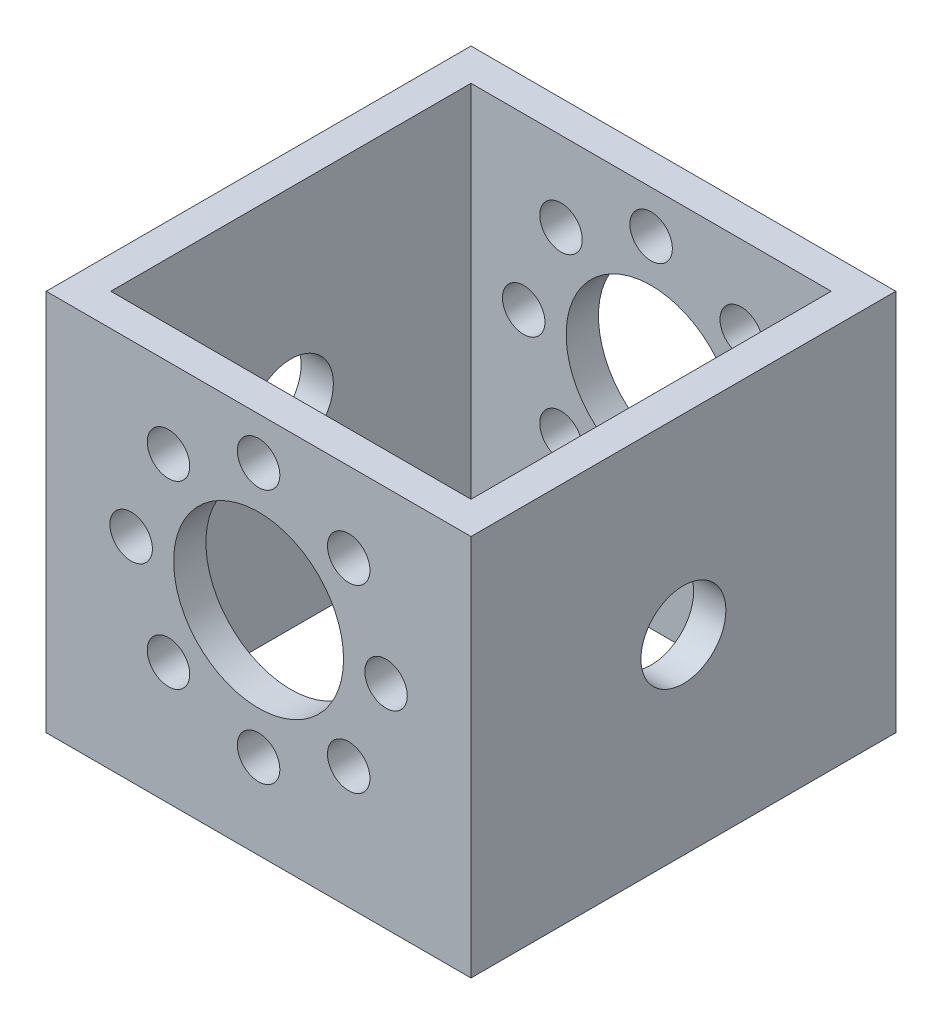
ISO-10303-21;
HEADER;
FILE_DESCRIPTION(('STEP AP214'),'2;1');
FILE_NAME('part.step','',(''),(''),'','','');
FILE_SCHEMA(('AUTOMOTIVE_DESIGN { 1 0 10303 214 1 1 1 1 }'));
ENDSEC;
DATA;
#1=APPLICATION_CONTEXT('core data for automotive mechanical design processes');
#2=APPLICATION_PROTOCOL_DEFINITION('international standard','automotive_design',2000,#1);
#3=PRODUCT_CONTEXT('',#1,'mechanical');
#4=PRODUCT('Part','Part','',(#3));
#5=PRODUCT_RELATED_PRODUCT_CATEGORY('part','',(#4));
#6=PRODUCT_DEFINITION_FORMATION('','',#4);
#7=PRODUCT_DEFINITION_CONTEXT('part definition',#1,'design');
#8=PRODUCT_DEFINITION('design','',#6,#7);
#9=PRODUCT_DEFINITION_SHAPE('','',#8);
#10=(LENGTH_UNIT() NAMED_UNIT(*) SI_UNIT(.MILLI.,.METRE.));
#11=(NAMED_UNIT(*) PLANE_ANGLE_UNIT() SI_UNIT($,.RADIAN.));
#12=(NAMED_UNIT(*) SI_UNIT($,.STERADIAN.) SOLID_ANGLE_UNIT());
#13=UNCERTAINTY_MEASURE_WITH_UNIT(LENGTH_MEASURE(1.E-05),#10,'distance_accuracy_value','');
#14=(GEOMETRIC_REPRESENTATION_CONTEXT(3) GLOBAL_UNCERTAINTY_ASSIGNED_CONTEXT((#13)) GLOBAL_UNIT_ASSIGNED_CONTEXT((#10,
#11,#12)) REPRESENTATION_CONTEXT('',''));
#15=CARTESIAN_POINT('',(0.,0.,0.));
#16=DIRECTION('',(0.,0.,1.));
#17=DIRECTION('',(1.,0.,0.));
#18=AXIS2_PLACEMENT_3D('',#15,#16,#17);
#19=CARTESIAN_POINT('',(0.,0.,4.826));
#20=DIRECTION('',(0.,0.,1.));
#21=DIRECTION('',(1.,0.,0.));
#22=AXIS2_PLACEMENT_3D('',#19,#20,#21);
#23=PLANE('',#22);
#24=CARTESIAN_POINT('',(-19.0499999999992,-8.12150346973795E-13,4.826));
#25=DIRECTION('',(0.,0.,1.));
#26=DIRECTION('',(1.,0.,0.));
#27=AXIS2_PLACEMENT_3D('',#24,#25,#26);
#28=CIRCLE('',#27,3.17500000000121);
#29=CARTESIAN_POINT('',(-15.874999999998,-8.12150346973795E-13,4.826));
#30=VERTEX_POINT('',#29);
#31=EDGE_CURVE('E161',#30,#30,#28,.T.);
#32=ORIENTED_EDGE('',*,*,#31,.F.);
#33=EDGE_LOOP('',(#32));
#34=FACE_BOUND('',#33,.T.);
#35=CARTESIAN_POINT('',(1.61963478964284E-12,-19.05,4.826));
#36=DIRECTION('',(0.,0.,1.));
#37=DIRECTION('',(1.,0.,0.));
#38=AXIS2_PLACEMENT_3D('',#35,#36,#37);
#39=CIRCLE('',#38,3.17500000000168);
#40=CARTESIAN_POINT('',(3.1750000000033,-19.05,4.826));
#41=VERTEX_POINT('',#40);
#42=EDGE_CURVE('E173',#41,#41,#39,.T.);
#43=ORIENTED_EDGE('',*,*,#42,.F.);
#44=EDGE_LOOP('',(#43));
#45=FACE_BOUND('',#44,.T.);
#46=CARTESIAN_POINT('',(19.0500000000008,8.09817394821419E-13,4.826));
#47=DIRECTION('',(0.,0.,1.));
#48=DIRECTION('',(1.,0.,0.));
#49=AXIS2_PLACEMENT_3D('',#46,#47,#48);
#50=CIRCLE('',#49,3.1750000000006);
#51=CARTESIAN_POINT('',(22.2250000000014,8.09817394821419E-13,4.826));
#52=VERTEX_POINT('',#51);
#53=EDGE_CURVE('E185',#52,#52,#50,.T.);
#54=ORIENTED_EDGE('',*,*,#53,.F.);
#55=EDGE_LOOP('',(#54));
#56=FACE_BOUND('',#55,.T.);
#57=CARTESIAN_POINT('',(0.,19.05,4.826));
#58=DIRECTION('',(0.,0.,1.));
#59=DIRECTION('',(1.,0.,0.));
#60=AXIS2_PLACEMENT_3D('',#57,#58,#59);
#61=CIRCLE('',#60,3.175);
#62=CARTESIAN_POINT('',(3.175,19.05,4.826));
#63=VERTEX_POINT('',#62);
#64=EDGE_CURVE('E197',#63,#63,#61,.T.);
#65=ORIENTED_EDGE('',*,*,#64,.F.);
#66=EDGE_LOOP('',(#65));
#67=FACE_BOUND('',#66,.T.);
#68=CARTESIAN_POINT('',(0.,0.,4.826));
#69=DIRECTION('',(0.,0.,1.));
#70=DIRECTION('',(1.,0.,0.));
#71=AXIS2_PLACEMENT_3D('',#68,#69,#70);
#72=CIRCLE('',#71,12.7);
#73=CARTESIAN_POINT('',(12.7,0.,4.826));
#74=VERTEX_POINT('',#73);
#75=EDGE_CURVE('E203',#74,#74,#72,.T.);
#76=ORIENTED_EDGE('',*,*,#75,.F.);
#77=EDGE_LOOP('',(#76));
#78=FACE_BOUND('',#77,.T.);
#79=CARTESIAN_POINT('',(13.4703841816038,13.4703841816037,4.826));
#80=DIRECTION('',(0.,0.,1.));
#81=DIRECTION('',(1.,0.,0.));
#82=AXIS2_PLACEMENT_3D('',#79,#80,#81);
#83=CIRCLE('',#82,3.175);
#84=CARTESIAN_POINT('',(16.6453841816038,13.4703841816037,4.826));
#85=VERTEX_POINT('',#84);
#86=EDGE_CURVE('E191',#85,#85,#83,.T.);
#87=ORIENTED_EDGE('',*,*,#86,.F.);
#88=EDGE_LOOP('',(#87));
#89=FACE_BOUND('',#88,.T.);
#90=CARTESIAN_POINT('',(13.4703841816051,-13.4703841816032,4.826));
#91=DIRECTION('',(0.,0.,1.));
#92=DIRECTION('',(1.,0.,0.));
#93=AXIS2_PLACEMENT_3D('',#90,#91,#92);
#94=CIRCLE('',#93,3.17500000000125);
#95=CARTESIAN_POINT('',(16.6453841816064,-13.4703841816032,4.826));
#96=VERTEX_POINT('',#95);
#97=EDGE_CURVE('E179',#96,#96,#94,.T.);
#98=ORIENTED_EDGE('',*,*,#97,.F.);
#99=EDGE_LOOP('',(#98));
#100=FACE_BOUND('',#99,.T.);
#101=CARTESIAN_POINT('',(-13.4703841816024,-13.4703841816043,4.826));
#102=DIRECTION('',(0.,0.,1.));
#103=DIRECTION('',(1.,0.,0.));
#104=AXIS2_PLACEMENT_3D('',#101,#102,#103);
#105=CIRCLE('',#104,3.17500000000165);
#106=CARTESIAN_POINT('',(-10.2953841816007,-13.4703841816043,4.826));
#107=VERTEX_POINT('',#106);
#108=EDGE_CURVE('E167',#107,#107,#105,.T.);
#109=ORIENTED_EDGE('',*,*,#108,.F.);
#110=EDGE_LOOP('',(#109));
#111=FACE_BOUND('',#110,.T.);
#112=CARTESIAN_POINT('',(-13.4703841816035,13.4703841816032,4.826));
#113=DIRECTION('',(0.,0.,1.));
#114=DIRECTION('',(1.,0.,0.));
#115=AXIS2_PLACEMENT_3D('',#112,#113,#114);
#116=CIRCLE('',#115,3.17500000000062);
#117=CARTESIAN_POINT('',(-10.2953841816029,13.4703841816032,4.826));
#118=VERTEX_POINT('',#117);
#119=EDGE_CURVE('E155',#118,#118,#116,.T.);
#120=ORIENTED_EDGE('',*,*,#119,.F.);
#121=EDGE_LOOP('',(#120));
#122=FACE_BOUND('',#121,.T.);
#123=DIRECTION('',(-1.,0.,0.));
#124=VECTOR('',#123,1.);
#125=CARTESIAN_POINT('',(-31.75,25.4,4.826));
#126=LINE('',#125,#124);
#127=CARTESIAN_POINT('',(26.924,25.4,4.826));
#128=VERTEX_POINT('',#127);
#129=CARTESIAN_POINT('',(-26.924,25.4,4.826));
#130=VERTEX_POINT('',#129);
#131=EDGE_CURVE('E55',#128,#130,#126,.T.);
#132=ORIENTED_EDGE('',*,*,#131,.T.);
#133=DIRECTION('',(0.,1.,0.));
#134=VECTOR('',#133,1.);
#135=CARTESIAN_POINT('',(-26.924,-31.75,4.826));
#136=LINE('',#135,#134);
#137=CARTESIAN_POINT('',(-26.924,-31.75,4.826));
#138=VERTEX_POINT('',#137);
#139=EDGE_CURVE('E50',#138,#130,#136,.T.);
#140=ORIENTED_EDGE('',*,*,#139,.F.);
#141=DIRECTION('',(1.,0.,0.));
#142=VECTOR('',#141,1.);
#143=CARTESIAN_POINT('',(-31.75,-31.75,4.826));
#144=LINE('',#143,#142);
#145=CARTESIAN_POINT('',(26.924,-31.75,4.826));
#146=VERTEX_POINT('',#145);
#147=EDGE_CURVE('E209',#138,#146,#144,.T.);
#148=ORIENTED_EDGE('',*,*,#147,.T.);
#149=DIRECTION('',(0.,1.,0.));
#150=VECTOR('',#149,1.);
#151=CARTESIAN_POINT('',(26.924,-31.75,4.826));
#152=LINE('',#151,#150);
#153=EDGE_CURVE('E144',#146,#128,#152,.T.);
#154=ORIENTED_EDGE('',*,*,#153,.T.);
#155=EDGE_LOOP('',(#132,#140,#148,#154));
#156=FACE_BOUND('',#155,.T.);
#157=ADVANCED_FACE('F35',(#34,#45,#56,#67,#78,#89,#100,#111,#122,#156),#23,.T.);
#158=CARTESIAN_POINT('',(0.,0.,58.674));
#159=DIRECTION('',(0.,0.,-1.));
#160=DIRECTION('',(1.,0.,0.));
#161=AXIS2_PLACEMENT_3D('',#158,#159,#160);
#162=PLANE('',#161);
#163=CARTESIAN_POINT('',(-13.4703841816035,13.4703841816032,58.674));
#164=DIRECTION('',(0.,0.,1.));
#165=DIRECTION('',(1.,0.,0.));
#166=AXIS2_PLACEMENT_3D('',#163,#164,#165);
#167=CIRCLE('',#166,3.17500000000062);
#168=CARTESIAN_POINT('',(-10.2953841816029,13.4703841816032,58.674));
#169=VERTEX_POINT('',#168);
#170=EDGE_CURVE('E557',#169,#169,#167,.T.);
#171=ORIENTED_EDGE('',*,*,#170,.T.);
#172=EDGE_LOOP('',(#171));
#173=FACE_BOUND('',#172,.T.);
#174=CARTESIAN_POINT('',(-19.0499999999992,-8.12150346973795E-13,58.674));
#175=DIRECTION('',(0.,0.,1.));
#176=DIRECTION('',(1.,0.,0.));
#177=AXIS2_PLACEMENT_3D('',#174,#175,#176);
#178=CIRCLE('',#177,3.17500000000121);
#179=CARTESIAN_POINT('',(-15.874999999998,-8.12150346973795E-13,58.674));
#180=VERTEX_POINT('',#179);
#181=EDGE_CURVE('E563',#180,#180,#178,.T.);
#182=ORIENTED_EDGE('',*,*,#181,.T.);
#183=EDGE_LOOP('',(#182));
#184=FACE_BOUND('',#183,.T.);
#185=CARTESIAN_POINT('',(-13.4703841816024,-13.4703841816043,58.674));
#186=DIRECTION('',(0.,0.,1.));
#187=DIRECTION('',(1.,0.,0.));
#188=AXIS2_PLACEMENT_3D('',#185,#186,#187);
#189=CIRCLE('',#188,3.17500000000165);
#190=CARTESIAN_POINT('',(-10.2953841816007,-13.4703841816043,58.674));
#191=VERTEX_POINT('',#190);
#192=EDGE_CURVE('E569',#191,#191,#189,.T.);
#193=ORIENTED_EDGE('',*,*,#192,.T.);
#194=EDGE_LOOP('',(#193));
#195=FACE_BOUND('',#194,.T.);
#196=CARTESIAN_POINT('',(1.61963478964284E-12,-19.05,58.674));
#197=DIRECTION('',(0.,0.,1.));
#198=DIRECTION('',(1.,0.,0.));
#199=AXIS2_PLACEMENT_3D('',#196,#197,#198);
#200=CIRCLE('',#199,3.17500000000168);
#201=CARTESIAN_POINT('',(3.1750000000033,-19.05,58.674));
#202=VERTEX_POINT('',#201);
#203=EDGE_CURVE('E575',#202,#202,#200,.T.);
#204=ORIENTED_EDGE('',*,*,#203,.T.);
#205=EDGE_LOOP('',(#204));
#206=FACE_BOUND('',#205,.T.);
#207=CARTESIAN_POINT('',(13.4703841816051,-13.4703841816032,58.674));
#208=DIRECTION('',(0.,0.,1.));
#209=DIRECTION('',(1.,0.,0.));
#210=AXIS2_PLACEMENT_3D('',#207,#208,#209);
#211=CIRCLE('',#210,3.17500000000125);
#212=CARTESIAN_POINT('',(16.6453841816064,-13.4703841816032,58.674));
#213=VERTEX_POINT('',#212);
#214=EDGE_CURVE('E581',#213,#213,#211,.T.);
#215=ORIENTED_EDGE('',*,*,#214,.T.);
#216=EDGE_LOOP('',(#215));
#217=FACE_BOUND('',#216,.T.);
#218=CARTESIAN_POINT('',(19.0500000000008,8.09817394821419E-13,58.674));
#219=DIRECTION('',(0.,0.,1.));
#220=DIRECTION('',(1.,0.,0.));
#221=AXIS2_PLACEMENT_3D('',#218,#219,#220);
#222=CIRCLE('',#221,3.1750000000006);
#223=CARTESIAN_POINT('',(22.2250000000014,8.09817394821419E-13,58.674));
#224=VERTEX_POINT('',#223);
#225=EDGE_CURVE('E587',#224,#224,#222,.T.);
#226=ORIENTED_EDGE('',*,*,#225,.T.);
#227=EDGE_LOOP('',(#226));
#228=FACE_BOUND('',#227,.T.);
#229=CARTESIAN_POINT('',(13.4703841816038,13.4703841816037,58.674));
#230=DIRECTION('',(0.,0.,1.));
#231=DIRECTION('',(1.,0.,0.));
#232=AXIS2_PLACEMENT_3D('',#229,#230,#231);
#233=CIRCLE('',#232,3.175);
#234=CARTESIAN_POINT('',(16.6453841816038,13.4703841816037,58.674));
#235=VERTEX_POINT('',#234);
#236=EDGE_CURVE('E593',#235,#235,#233,.T.);
#237=ORIENTED_EDGE('',*,*,#236,.T.);
#238=EDGE_LOOP('',(#237));
#239=FACE_BOUND('',#238,.T.);
#240=CARTESIAN_POINT('',(0.,19.05,58.674));
#241=DIRECTION('',(0.,0.,1.));
#242=DIRECTION('',(1.,0.,0.));
#243=AXIS2_PLACEMENT_3D('',#240,#241,#242);
#244=CIRCLE('',#243,3.175);
#245=CARTESIAN_POINT('',(3.175,19.05,58.674));
#246=VERTEX_POINT('',#245);
#247=EDGE_CURVE('E599',#246,#246,#244,.T.);
#248=ORIENTED_EDGE('',*,*,#247,.T.);
#249=EDGE_LOOP('',(#248));
#250=FACE_BOUND('',#249,.T.);
#251=CARTESIAN_POINT('',(0.,0.,58.674));
#252=DIRECTION('',(0.,0.,1.));
#253=DIRECTION('',(1.,0.,0.));
#254=AXIS2_PLACEMENT_3D('',#251,#252,#253);
#255=CIRCLE('',#254,12.7);
#256=CARTESIAN_POINT('',(12.7,0.,58.674));
#257=VERTEX_POINT('',#256);
#258=EDGE_CURVE('E136',#257,#257,#255,.T.);
#259=ORIENTED_EDGE('',*,*,#258,.T.);
#260=EDGE_LOOP('',(#259));
#261=FACE_BOUND('',#260,.T.);
#262=DIRECTION('',(1.,0.,0.));
#263=VECTOR('',#262,1.);
#264=CARTESIAN_POINT('',(-31.75,-31.75,58.674));
#265=LINE('',#264,#263);
#266=CARTESIAN_POINT('',(-26.924,-31.75,58.674));
#267=VERTEX_POINT('',#266);
#268=CARTESIAN_POINT('',(26.924,-31.75,58.674));
#269=VERTEX_POINT('',#268);
#270=EDGE_CURVE('E115',#267,#269,#265,.T.);
#271=ORIENTED_EDGE('',*,*,#270,.F.);
#272=DIRECTION('',(0.,-1.,0.));
#273=VECTOR('',#272,1.);
#274=CARTESIAN_POINT('',(-26.924,25.4,58.674));
#275=LINE('',#274,#273);
#276=CARTESIAN_POINT('',(-26.924,25.4,58.674));
#277=VERTEX_POINT('',#276);
#278=EDGE_CURVE('E104',#277,#267,#275,.T.);
#279=ORIENTED_EDGE('',*,*,#278,.F.);
#280=DIRECTION('',(-1.,0.,0.));
#281=VECTOR('',#280,1.);
#282=CARTESIAN_POINT('',(-31.75,25.4,58.674));
#283=LINE('',#282,#281);
#284=CARTESIAN_POINT('',(26.924,25.4,58.674));
#285=VERTEX_POINT('',#284);
#286=EDGE_CURVE('E114',#285,#277,#283,.T.);
#287=ORIENTED_EDGE('',*,*,#286,.F.);
#288=DIRECTION('',(0.,-1.,0.));
#289=VECTOR('',#288,1.);
#290=CARTESIAN_POINT('',(26.924,25.4,58.674));
#291=LINE('',#290,#289);
#292=EDGE_CURVE('E149',#285,#269,#291,.T.);
#293=ORIENTED_EDGE('',*,*,#292,.T.);
#294=EDGE_LOOP('',(#271,#279,#287,#293));
#295=FACE_BOUND('',#294,.T.);
#296=ADVANCED_FACE('F112',(#173,#184,#195,#206,#217,#228,#239,#250,#261,#295),#162,.T.);
#297=CARTESIAN_POINT('',(0.,0.,0.));
#298=DIRECTION('',(0.,0.,1.));
#299=DIRECTION('',(1.,0.,0.));
#300=AXIS2_PLACEMENT_3D('',#297,#298,#299);
#301=PLANE('',#300);
#302=DIRECTION('',(0.,-1.,0.));
#303=VECTOR('',#302,1.);
#304=CARTESIAN_POINT('',(-31.75,25.4,0.));
#305=LINE('',#304,#303);
#306=CARTESIAN_POINT('',(-31.75,25.4,0.));
#307=VERTEX_POINT('',#306);
#308=CARTESIAN_POINT('',(-31.75,-31.75,0.));
#309=VERTEX_POINT('',#308);
#310=EDGE_CURVE('E206',#307,#309,#305,.T.);
#311=ORIENTED_EDGE('',*,*,#310,.F.);
#312=DIRECTION('',(-1.,0.,0.));
#313=VECTOR('',#312,1.);
#314=CARTESIAN_POINT('',(-31.75,25.4,0.));
#315=LINE('',#314,#313);
#316=CARTESIAN_POINT('',(31.75,25.4,0.));
#317=VERTEX_POINT('',#316);
#318=EDGE_CURVE('E211',#317,#307,#315,.T.);
#319=ORIENTED_EDGE('',*,*,#318,.F.);
#320=DIRECTION('',(0.,1.,0.));
#321=VECTOR('',#320,1.);
#322=CARTESIAN_POINT('',(31.75,25.4,0.));
#323=LINE('',#322,#321);
#324=CARTESIAN_POINT('',(31.75,-31.75,0.));
#325=VERTEX_POINT('',#324);
#326=EDGE_CURVE('E218',#325,#317,#323,.T.);
#327=ORIENTED_EDGE('',*,*,#326,.F.);
#328=DIRECTION('',(1.,0.,0.));
#329=VECTOR('',#328,1.);
#330=CARTESIAN_POINT('',(-31.75,-31.75,0.));
#331=LINE('',#330,#329);
#332=EDGE_CURVE('E216',#309,#325,#331,.T.);
#333=ORIENTED_EDGE('',*,*,#332,.F.);
#334=EDGE_LOOP('',(#311,#319,#327,#333));
#335=FACE_BOUND('',#334,.T.);
#336=CARTESIAN_POINT('',(0.,0.,0.));
#337=DIRECTION('',(0.,0.,1.));
#338=DIRECTION('',(1.,0.,0.));
#339=AXIS2_PLACEMENT_3D('',#336,#337,#338);
#340=CIRCLE('',#339,12.7);
#341=CARTESIAN_POINT('',(12.7,0.,0.));
#342=VERTEX_POINT('',#341);
#343=EDGE_CURVE('E200',#342,#342,#340,.T.);
#344=ORIENTED_EDGE('',*,*,#343,.T.);
#345=EDGE_LOOP('',(#344));
#346=FACE_BOUND('',#345,.T.);
#347=CARTESIAN_POINT('',(0.,19.05,0.));
#348=DIRECTION('',(0.,0.,1.));
#349=DIRECTION('',(1.,0.,0.));
#350=AXIS2_PLACEMENT_3D('',#347,#348,#349);
#351=CIRCLE('',#350,3.175);
#352=CARTESIAN_POINT('',(3.175,19.05,0.));
#353=VERTEX_POINT('',#352);
#354=EDGE_CURVE('E194',#353,#353,#351,.T.);
#355=ORIENTED_EDGE('',*,*,#354,.T.);
#356=EDGE_LOOP('',(#355));
#357=FACE_BOUND('',#356,.T.);
#358=CARTESIAN_POINT('',(13.4703841816038,13.4703841816037,0.));
#359=DIRECTION('',(0.,0.,1.));
#360=DIRECTION('',(1.,0.,0.));
#361=AXIS2_PLACEMENT_3D('',#358,#359,#360);
#362=CIRCLE('',#361,3.175);
#363=CARTESIAN_POINT('',(16.6453841816038,13.4703841816037,0.));
#364=VERTEX_POINT('',#363);
#365=EDGE_CURVE('E188',#364,#364,#362,.T.);
#366=ORIENTED_EDGE('',*,*,#365,.T.);
#367=EDGE_LOOP('',(#366));
#368=FACE_BOUND('',#367,.T.);
#369=CARTESIAN_POINT('',(19.0500000000008,8.09817394821419E-13,0.));
#370=DIRECTION('',(0.,0.,1.));
#371=DIRECTION('',(1.,0.,0.));
#372=AXIS2_PLACEMENT_3D('',#369,#370,#371);
#373=CIRCLE('',#372,3.1750000000006);
#374=CARTESIAN_POINT('',(22.2250000000014,8.09817394821419E-13,0.));
#375=VERTEX_POINT('',#374);
#376=EDGE_CURVE('E182',#375,#375,#373,.T.);
#377=ORIENTED_EDGE('',*,*,#376,.T.);
#378=EDGE_LOOP('',(#377));
#379=FACE_BOUND('',#378,.T.);
#380=CARTESIAN_POINT('',(13.4703841816051,-13.4703841816032,0.));
#381=DIRECTION('',(0.,0.,1.));
#382=DIRECTION('',(1.,0.,0.));
#383=AXIS2_PLACEMENT_3D('',#380,#381,#382);
#384=CIRCLE('',#383,3.17500000000125);
#385=CARTESIAN_POINT('',(16.6453841816064,-13.4703841816032,0.));
#386=VERTEX_POINT('',#385);
#387=EDGE_CURVE('E176',#386,#386,#384,.T.);
#388=ORIENTED_EDGE('',*,*,#387,.T.);
#389=EDGE_LOOP('',(#388));
#390=FACE_BOUND('',#389,.T.);
#391=CARTESIAN_POINT('',(1.61963478964284E-12,-19.05,0.));
#392=DIRECTION('',(0.,0.,1.));
#393=DIRECTION('',(1.,0.,0.));
#394=AXIS2_PLACEMENT_3D('',#391,#392,#393);
#395=CIRCLE('',#394,3.17500000000168);
#396=CARTESIAN_POINT('',(3.1750000000033,-19.05,0.));
#397=VERTEX_POINT('',#396);
#398=EDGE_CURVE('E170',#397,#397,#395,.T.);
#399=ORIENTED_EDGE('',*,*,#398,.T.);
#400=EDGE_LOOP('',(#399));
#401=FACE_BOUND('',#400,.T.);
#402=CARTESIAN_POINT('',(-13.4703841816024,-13.4703841816043,0.));
#403=DIRECTION('',(0.,0.,1.));
#404=DIRECTION('',(1.,0.,0.));
#405=AXIS2_PLACEMENT_3D('',#402,#403,#404);
#406=CIRCLE('',#405,3.17500000000165);
#407=CARTESIAN_POINT('',(-10.2953841816007,-13.4703841816043,0.));
#408=VERTEX_POINT('',#407);
#409=EDGE_CURVE('E164',#408,#408,#406,.T.);
#410=ORIENTED_EDGE('',*,*,#409,.T.);
#411=EDGE_LOOP('',(#410));
#412=FACE_BOUND('',#411,.T.);
#413=CARTESIAN_POINT('',(-19.0499999999992,-8.12150346973795E-13,0.));
#414=DIRECTION('',(0.,0.,1.));
#415=DIRECTION('',(1.,0.,0.));
#416=AXIS2_PLACEMENT_3D('',#413,#414,#415);
#417=CIRCLE('',#416,3.17500000000121);
#418=CARTESIAN_POINT('',(-15.874999999998,-8.12150346973795E-13,0.));
#419=VERTEX_POINT('',#418);
#420=EDGE_CURVE('E158',#419,#419,#417,.T.);
#421=ORIENTED_EDGE('',*,*,#420,.T.);
#422=EDGE_LOOP('',(#421));
#423=FACE_BOUND('',#422,.T.);
#424=CARTESIAN_POINT('',(-13.4703841816035,13.4703841816032,0.));
#425=DIRECTION('',(0.,0.,1.));
#426=DIRECTION('',(1.,0.,0.));
#427=AXIS2_PLACEMENT_3D('',#424,#425,#426);
#428=CIRCLE('',#427,3.17500000000062);
#429=CARTESIAN_POINT('',(-10.2953841816029,13.4703841816032,0.));
#430=VERTEX_POINT('',#429);
#431=EDGE_CURVE('E154',#430,#430,#428,.T.);
#432=ORIENTED_EDGE('',*,*,#431,.T.);
#433=EDGE_LOOP('',(#432));
#434=FACE_BOUND('',#433,.T.);
#435=ADVANCED_FACE('F236',(#335,#346,#357,#368,#379,#390,#401,#412,#423,#434),#301,.F.);
#436=CARTESIAN_POINT('',(-31.75,25.4,4.826));
#437=DIRECTION('',(1.,0.,0.));
#438=DIRECTION('',(0.,1.,0.));
#439=AXIS2_PLACEMENT_3D('',#436,#437,#438);
#440=PLANE('',#439);
#441=ORIENTED_EDGE('',*,*,#310,.T.);
#442=DIRECTION('',(0.,0.,-1.));
#443=VECTOR('',#442,1.);
#444=CARTESIAN_POINT('',(-31.75,-31.75,4.826));
#445=LINE('',#444,#443);
#446=CARTESIAN_POINT('',(-31.75,-31.75,63.5));
#447=VERTEX_POINT('',#446);
#448=EDGE_CURVE('E11',#447,#309,#445,.T.);
#449=ORIENTED_EDGE('',*,*,#448,.F.);
#450=DIRECTION('',(0.,-1.,0.));
#451=VECTOR('',#450,1.);
#452=CARTESIAN_POINT('',(-31.75,25.4,63.5));
#453=LINE('',#452,#451);
#454=CARTESIAN_POINT('',(-31.75,25.4,63.5));
#455=VERTEX_POINT('',#454);
#456=EDGE_CURVE('E132',#455,#447,#453,.T.);
#457=ORIENTED_EDGE('',*,*,#456,.F.);
#458=DIRECTION('',(0.,0.,-1.));
#459=VECTOR('',#458,1.);
#460=CARTESIAN_POINT('',(-31.75,25.4,4.826));
#461=LINE('',#460,#459);
#462=EDGE_CURVE('E213',#455,#307,#461,.T.);
#463=ORIENTED_EDGE('',*,*,#462,.T.);
#464=EDGE_LOOP('',(#441,#449,#457,#463));
#465=FACE_BOUND('',#464,.T.);
#466=CARTESIAN_POINT('',(-31.75,-3.17500000000001,31.75));
#467=DIRECTION('',(1.,0.,0.));
#468=DIRECTION('',(0.,0.,-1.));
#469=AXIS2_PLACEMENT_3D('',#466,#467,#468);
#470=CIRCLE('',#469,6.35);
#471=CARTESIAN_POINT('',(-31.75,-3.17500000000001,25.4));
#472=VERTEX_POINT('',#471);
#473=EDGE_CURVE('E551',#472,#472,#470,.T.);
#474=ORIENTED_EDGE('',*,*,#473,.T.);
#475=EDGE_LOOP('',(#474));
#476=FACE_BOUND('',#475,.T.);
#477=ADVANCED_FACE('F37',(#465,#476),#440,.F.);
#478=CARTESIAN_POINT('',(-31.75,-31.75,4.826));
#479=DIRECTION('',(0.,1.,0.));
#480=DIRECTION('',(-1.,0.,0.));
#481=AXIS2_PLACEMENT_3D('',#478,#479,#480);
#482=PLANE('',#481);
#483=ORIENTED_EDGE('',*,*,#147,.F.);
#484=DIRECTION('',(0.,0.,-1.));
#485=VECTOR('',#484,1.);
#486=CARTESIAN_POINT('',(-26.924,-31.75,58.674));
#487=LINE('',#486,#485);
#488=EDGE_CURVE('E116',#267,#138,#487,.T.);
#489=ORIENTED_EDGE('',*,*,#488,.F.);
#490=ORIENTED_EDGE('',*,*,#270,.T.);
#491=DIRECTION('',(0.,0.,-1.));
#492=VECTOR('',#491,1.);
#493=CARTESIAN_POINT('',(26.924,-31.75,58.674));
#494=LINE('',#493,#492);
#495=EDGE_CURVE('E151',#269,#146,#494,.T.);
#496=ORIENTED_EDGE('',*,*,#495,.T.);
#497=EDGE_LOOP('',(#483,#489,#490,#496));
#498=FACE_BOUND('',#497,.T.);
#499=ORIENTED_EDGE('',*,*,#332,.T.);
#500=DIRECTION('',(0.,0.,-1.));
#501=VECTOR('',#500,1.);
#502=CARTESIAN_POINT('',(31.75,-31.75,4.826));
#503=LINE('',#502,#501);
#504=CARTESIAN_POINT('',(31.75,-31.75,63.5));
#505=VERTEX_POINT('',#504);
#506=EDGE_CURVE('E43',#505,#325,#503,.T.);
#507=ORIENTED_EDGE('',*,*,#506,.F.);
#508=DIRECTION('',(1.,0.,0.));
#509=VECTOR('',#508,1.);
#510=CARTESIAN_POINT('',(-31.75,-31.75,63.5));
#511=LINE('',#510,#509);
#512=EDGE_CURVE('E121',#447,#505,#511,.T.);
#513=ORIENTED_EDGE('',*,*,#512,.F.);
#514=ORIENTED_EDGE('',*,*,#448,.T.);
#515=EDGE_LOOP('',(#499,#507,#513,#514));
#516=FACE_BOUND('',#515,.T.);
#517=ADVANCED_FACE('F245',(#498,#516),#482,.F.);
#518=CARTESIAN_POINT('',(31.75,25.4,4.826));
#519=DIRECTION('',(-1.,0.,0.));
#520=DIRECTION('',(0.,0.,1.));
#521=AXIS2_PLACEMENT_3D('',#518,#519,#520);
#522=PLANE('',#521);
#523=ORIENTED_EDGE('',*,*,#326,.T.);
#524=DIRECTION('',(0.,0.,-1.));
#525=VECTOR('',#524,1.);
#526=CARTESIAN_POINT('',(31.75,25.4,4.826));
#527=LINE('',#526,#525);
#528=CARTESIAN_POINT('',(31.75,25.4,63.5));
#529=VERTEX_POINT('',#528);
#530=EDGE_CURVE('E223',#529,#317,#527,.T.);
#531=ORIENTED_EDGE('',*,*,#530,.F.);
#532=DIRECTION('',(0.,1.,0.));
#533=VECTOR('',#532,1.);
#534=CARTESIAN_POINT('',(31.75,25.4,63.5));
#535=LINE('',#534,#533);
#536=EDGE_CURVE('E126',#505,#529,#535,.T.);
#537=ORIENTED_EDGE('',*,*,#536,.F.);
#538=ORIENTED_EDGE('',*,*,#506,.T.);
#539=EDGE_LOOP('',(#523,#531,#537,#538));
#540=FACE_BOUND('',#539,.T.);
#541=CARTESIAN_POINT('',(31.75,-3.175,31.75));
#542=DIRECTION('',(1.,0.,0.));
#543=DIRECTION('',(0.,0.,-1.));
#544=AXIS2_PLACEMENT_3D('',#541,#542,#543);
#545=CIRCLE('',#544,6.35);
#546=CARTESIAN_POINT('',(31.75,-3.175,25.4));
#547=VERTEX_POINT('',#546);
#548=EDGE_CURVE('E123',#547,#547,#545,.T.);
#549=ORIENTED_EDGE('',*,*,#548,.F.);
#550=EDGE_LOOP('',(#549));
#551=FACE_BOUND('',#550,.T.);
#552=ADVANCED_FACE('F229',(#540,#551),#522,.F.);
#553=CARTESIAN_POINT('',(-31.75,25.4,4.826));
#554=DIRECTION('',(0.,-1.,0.));
#555=DIRECTION('',(1.,0.,0.));
#556=AXIS2_PLACEMENT_3D('',#553,#554,#555);
#557=PLANE('',#556);
#558=ORIENTED_EDGE('',*,*,#462,.F.);
#559=DIRECTION('',(-1.,0.,0.));
#560=VECTOR('',#559,1.);
#561=CARTESIAN_POINT('',(-31.75,25.4,63.5));
#562=LINE('',#561,#560);
#563=EDGE_CURVE('E135',#529,#455,#562,.T.);
#564=ORIENTED_EDGE('',*,*,#563,.F.);
#565=ORIENTED_EDGE('',*,*,#530,.T.);
#566=ORIENTED_EDGE('',*,*,#318,.T.);
#567=EDGE_LOOP('',(#558,#564,#565,#566));
#568=FACE_BOUND('',#567,.T.);
#569=DIRECTION('',(0.,0.,1.));
#570=VECTOR('',#569,1.);
#571=CARTESIAN_POINT('',(-26.924,25.4,4.826));
#572=LINE('',#571,#570);
#573=EDGE_CURVE('E99',#130,#277,#572,.T.);
#574=ORIENTED_EDGE('',*,*,#573,.F.);
#575=ORIENTED_EDGE('',*,*,#131,.F.);
#576=DIRECTION('',(0.,0.,1.));
#577=VECTOR('',#576,1.);
#578=CARTESIAN_POINT('',(26.924,25.4,4.826));
#579=LINE('',#578,#577);
#580=EDGE_CURVE('E120',#128,#285,#579,.T.);
#581=ORIENTED_EDGE('',*,*,#580,.T.);
#582=ORIENTED_EDGE('',*,*,#286,.T.);
#583=EDGE_LOOP('',(#574,#575,#581,#582));
#584=FACE_BOUND('',#583,.T.);
#585=ADVANCED_FACE('F119',(#568,#584),#557,.F.);
#586=CARTESIAN_POINT('',(0.,0.,4.826));
#587=DIRECTION('',(0.,0.,-1.));
#588=DIRECTION('',(-1.,0.,0.));
#589=AXIS2_PLACEMENT_3D('',#586,#587,#588);
#590=CYLINDRICAL_SURFACE('',#589,12.7);
#591=ORIENTED_EDGE('',*,*,#75,.T.);
#592=EDGE_LOOP('',(#591));
#593=FACE_BOUND('',#592,.T.);
#594=ORIENTED_EDGE('',*,*,#343,.F.);
#595=EDGE_LOOP('',(#594));
#596=FACE_BOUND('',#595,.T.);
#597=ADVANCED_FACE('F265',(#593,#596),#590,.F.);
#598=CARTESIAN_POINT('',(0.,19.05,4.826));
#599=DIRECTION('',(0.,0.,-1.));
#600=DIRECTION('',(-1.,0.,0.));
#601=AXIS2_PLACEMENT_3D('',#598,#599,#600);
#602=CYLINDRICAL_SURFACE('',#601,3.175);
#603=ORIENTED_EDGE('',*,*,#64,.T.);
#604=EDGE_LOOP('',(#603));
#605=FACE_BOUND('',#604,.T.);
#606=ORIENTED_EDGE('',*,*,#354,.F.);
#607=EDGE_LOOP('',(#606));
#608=FACE_BOUND('',#607,.T.);
#609=ADVANCED_FACE('F273',(#605,#608),#602,.F.);
#610=CARTESIAN_POINT('',(13.4703841816038,13.4703841816037,4.826));
#611=DIRECTION('',(0.,0.,-1.));
#612=DIRECTION('',(-1.,0.,0.));
#613=AXIS2_PLACEMENT_3D('',#610,#611,#612);
#614=CYLINDRICAL_SURFACE('',#613,3.175);
#615=ORIENTED_EDGE('',*,*,#86,.T.);
#616=EDGE_LOOP('',(#615));
#617=FACE_BOUND('',#616,.T.);
#618=ORIENTED_EDGE('',*,*,#365,.F.);
#619=EDGE_LOOP('',(#618));
#620=FACE_BOUND('',#619,.T.);
#621=ADVANCED_FACE('F278',(#617,#620),#614,.F.);
#622=CARTESIAN_POINT('',(19.0500000000008,8.09817394821419E-13,4.826));
#623=DIRECTION('',(0.,0.,-1.));
#624=DIRECTION('',(-1.,0.,0.));
#625=AXIS2_PLACEMENT_3D('',#622,#623,#624);
#626=CYLINDRICAL_SURFACE('',#625,3.1750000000006);
#627=ORIENTED_EDGE('',*,*,#53,.T.);
#628=EDGE_LOOP('',(#627));
#629=FACE_BOUND('',#628,.T.);
#630=ORIENTED_EDGE('',*,*,#376,.F.);
#631=EDGE_LOOP('',(#630));
#632=FACE_BOUND('',#631,.T.);
#633=ADVANCED_FACE('F328',(#629,#632),#626,.F.);
#634=CARTESIAN_POINT('',(13.4703841816051,-13.4703841816032,4.826));
#635=DIRECTION('',(0.,0.,-1.));
#636=DIRECTION('',(-1.,0.,0.));
#637=AXIS2_PLACEMENT_3D('',#634,#635,#636);
#638=CYLINDRICAL_SURFACE('',#637,3.17500000000125);
#639=ORIENTED_EDGE('',*,*,#97,.T.);
#640=EDGE_LOOP('',(#639));
#641=FACE_BOUND('',#640,.T.);
#642=ORIENTED_EDGE('',*,*,#387,.F.);
#643=EDGE_LOOP('',(#642));
#644=FACE_BOUND('',#643,.T.);
#645=ADVANCED_FACE('F324',(#641,#644),#638,.F.);
#646=CARTESIAN_POINT('',(1.61963478964284E-12,-19.05,4.826));
#647=DIRECTION('',(0.,0.,-1.));
#648=DIRECTION('',(-1.,0.,0.));
#649=AXIS2_PLACEMENT_3D('',#646,#647,#648);
#650=CYLINDRICAL_SURFACE('',#649,3.17500000000168);
#651=ORIENTED_EDGE('',*,*,#42,.T.);
#652=EDGE_LOOP('',(#651));
#653=FACE_BOUND('',#652,.T.);
#654=ORIENTED_EDGE('',*,*,#398,.F.);
#655=EDGE_LOOP('',(#654));
#656=FACE_BOUND('',#655,.T.);
#657=ADVANCED_FACE('F320',(#653,#656),#650,.F.);
#658=CARTESIAN_POINT('',(-13.4703841816024,-13.4703841816043,4.826));
#659=DIRECTION('',(0.,0.,-1.));
#660=DIRECTION('',(-1.,0.,0.));
#661=AXIS2_PLACEMENT_3D('',#658,#659,#660);
#662=CYLINDRICAL_SURFACE('',#661,3.17500000000165);
#663=ORIENTED_EDGE('',*,*,#108,.T.);
#664=EDGE_LOOP('',(#663));
#665=FACE_BOUND('',#664,.T.);
#666=ORIENTED_EDGE('',*,*,#409,.F.);
#667=EDGE_LOOP('',(#666));
#668=FACE_BOUND('',#667,.T.);
#669=ADVANCED_FACE('F313',(#665,#668),#662,.F.);
#670=CARTESIAN_POINT('',(-19.0499999999992,-8.12150346973795E-13,4.826));
#671=DIRECTION('',(0.,0.,-1.));
#672=DIRECTION('',(-1.,0.,0.));
#673=AXIS2_PLACEMENT_3D('',#670,#671,#672);
#674=CYLINDRICAL_SURFACE('',#673,3.17500000000121);
#675=ORIENTED_EDGE('',*,*,#31,.T.);
#676=EDGE_LOOP('',(#675));
#677=FACE_BOUND('',#676,.T.);
#678=ORIENTED_EDGE('',*,*,#420,.F.);
#679=EDGE_LOOP('',(#678));
#680=FACE_BOUND('',#679,.T.);
#681=ADVANCED_FACE('F303',(#677,#680),#674,.F.);
#682=CARTESIAN_POINT('',(-13.4703841816035,13.4703841816032,4.826));
#683=DIRECTION('',(0.,0.,-1.));
#684=DIRECTION('',(-1.,0.,0.));
#685=AXIS2_PLACEMENT_3D('',#682,#683,#684);
#686=CYLINDRICAL_SURFACE('',#685,3.17500000000062);
#687=ORIENTED_EDGE('',*,*,#119,.T.);
#688=EDGE_LOOP('',(#687));
#689=FACE_BOUND('',#688,.T.);
#690=ORIENTED_EDGE('',*,*,#431,.F.);
#691=EDGE_LOOP('',(#690));
#692=FACE_BOUND('',#691,.T.);
#693=ADVANCED_FACE('F300',(#689,#692),#686,.F.);
#694=CARTESIAN_POINT('',(26.924,0.,0.));
#695=DIRECTION('',(1.,0.,0.));
#696=DIRECTION('',(0.,0.,-1.));
#697=AXIS2_PLACEMENT_3D('',#694,#695,#696);
#698=PLANE('',#697);
#699=CARTESIAN_POINT('',(26.924,-3.175,31.75));
#700=DIRECTION('',(1.,0.,0.));
#701=DIRECTION('',(0.,0.,-1.));
#702=AXIS2_PLACEMENT_3D('',#699,#700,#701);
#703=CIRCLE('',#702,6.35);
#704=CARTESIAN_POINT('',(26.924,-3.175,25.4));
#705=VERTEX_POINT('',#704);
#706=EDGE_CURVE('E141',#705,#705,#703,.T.);
#707=ORIENTED_EDGE('',*,*,#706,.T.);
#708=EDGE_LOOP('',(#707));
#709=FACE_BOUND('',#708,.T.);
#710=ORIENTED_EDGE('',*,*,#153,.F.);
#711=ORIENTED_EDGE('',*,*,#495,.F.);
#712=ORIENTED_EDGE('',*,*,#292,.F.);
#713=ORIENTED_EDGE('',*,*,#580,.F.);
#714=EDGE_LOOP('',(#710,#711,#712,#713));
#715=FACE_BOUND('',#714,.T.);
#716=ADVANCED_FACE('F302',(#709,#715),#698,.F.);
#717=CARTESIAN_POINT('',(26.924,-3.175,31.75));
#718=DIRECTION('',(1.,0.,0.));
#719=DIRECTION('',(0.,0.,-1.));
#720=AXIS2_PLACEMENT_3D('',#717,#718,#719);
#721=CYLINDRICAL_SURFACE('',#720,6.35);
#722=ORIENTED_EDGE('',*,*,#706,.F.);
#723=EDGE_LOOP('',(#722));
#724=FACE_BOUND('',#723,.T.);
#725=ORIENTED_EDGE('',*,*,#548,.T.);
#726=EDGE_LOOP('',(#725));
#727=FACE_BOUND('',#726,.T.);
#728=ADVANCED_FACE('F310',(#724,#727),#721,.F.);
#729=CARTESIAN_POINT('',(0.,0.,63.5));
#730=DIRECTION('',(0.,0.,-1.));
#731=DIRECTION('',(1.,0.,0.));
#732=AXIS2_PLACEMENT_3D('',#729,#730,#731);
#733=PLANE('',#732);
#734=CARTESIAN_POINT('',(-13.4703841816035,13.4703841816032,63.5));
#735=DIRECTION('',(0.,0.,1.));
#736=DIRECTION('',(1.,0.,0.));
#737=AXIS2_PLACEMENT_3D('',#734,#735,#736);
#738=CIRCLE('',#737,3.17500000000062);
#739=CARTESIAN_POINT('',(-10.2953841816029,13.4703841816032,63.5));
#740=VERTEX_POINT('',#739);
#741=EDGE_CURVE('E108',#740,#740,#738,.T.);
#742=ORIENTED_EDGE('',*,*,#741,.F.);
#743=EDGE_LOOP('',(#742));
#744=FACE_BOUND('',#743,.T.);
#745=CARTESIAN_POINT('',(-19.0499999999992,-8.12150346973795E-13,63.5));
#746=DIRECTION('',(0.,0.,1.));
#747=DIRECTION('',(1.,0.,0.));
#748=AXIS2_PLACEMENT_3D('',#745,#746,#747);
#749=CIRCLE('',#748,3.17500000000121);
#750=CARTESIAN_POINT('',(-15.874999999998,-8.12150346973795E-13,63.5));
#751=VERTEX_POINT('',#750);
#752=EDGE_CURVE('E560',#751,#751,#749,.T.);
#753=ORIENTED_EDGE('',*,*,#752,.F.);
#754=EDGE_LOOP('',(#753));
#755=FACE_BOUND('',#754,.T.);
#756=CARTESIAN_POINT('',(-13.4703841816024,-13.4703841816043,63.5));
#757=DIRECTION('',(0.,0.,1.));
#758=DIRECTION('',(1.,0.,0.));
#759=AXIS2_PLACEMENT_3D('',#756,#757,#758);
#760=CIRCLE('',#759,3.17500000000165);
#761=CARTESIAN_POINT('',(-10.2953841816007,-13.4703841816043,63.5));
#762=VERTEX_POINT('',#761);
#763=EDGE_CURVE('E566',#762,#762,#760,.T.);
#764=ORIENTED_EDGE('',*,*,#763,.F.);
#765=EDGE_LOOP('',(#764));
#766=FACE_BOUND('',#765,.T.);
#767=CARTESIAN_POINT('',(1.61963478964284E-12,-19.05,63.5));
#768=DIRECTION('',(0.,0.,1.));
#769=DIRECTION('',(1.,0.,0.));
#770=AXIS2_PLACEMENT_3D('',#767,#768,#769);
#771=CIRCLE('',#770,3.17500000000168);
#772=CARTESIAN_POINT('',(3.1750000000033,-19.05,63.5));
#773=VERTEX_POINT('',#772);
#774=EDGE_CURVE('E572',#773,#773,#771,.T.);
#775=ORIENTED_EDGE('',*,*,#774,.F.);
#776=EDGE_LOOP('',(#775));
#777=FACE_BOUND('',#776,.T.);
#778=CARTESIAN_POINT('',(13.4703841816051,-13.4703841816032,63.5));
#779=DIRECTION('',(0.,0.,1.));
#780=DIRECTION('',(1.,0.,0.));
#781=AXIS2_PLACEMENT_3D('',#778,#779,#780);
#782=CIRCLE('',#781,3.17500000000125);
#783=CARTESIAN_POINT('',(16.6453841816064,-13.4703841816032,63.5));
#784=VERTEX_POINT('',#783);
#785=EDGE_CURVE('E578',#784,#784,#782,.T.);
#786=ORIENTED_EDGE('',*,*,#785,.F.);
#787=EDGE_LOOP('',(#786));
#788=FACE_BOUND('',#787,.T.);
#789=CARTESIAN_POINT('',(19.0500000000008,8.09817394821419E-13,63.5));
#790=DIRECTION('',(0.,0.,1.));
#791=DIRECTION('',(1.,0.,0.));
#792=AXIS2_PLACEMENT_3D('',#789,#790,#791);
#793=CIRCLE('',#792,3.1750000000006);
#794=CARTESIAN_POINT('',(22.2250000000014,8.09817394821419E-13,63.5));
#795=VERTEX_POINT('',#794);
#796=EDGE_CURVE('E584',#795,#795,#793,.T.);
#797=ORIENTED_EDGE('',*,*,#796,.F.);
#798=EDGE_LOOP('',(#797));
#799=FACE_BOUND('',#798,.T.);
#800=CARTESIAN_POINT('',(13.4703841816038,13.4703841816037,63.5));
#801=DIRECTION('',(0.,0.,1.));
#802=DIRECTION('',(1.,0.,0.));
#803=AXIS2_PLACEMENT_3D('',#800,#801,#802);
#804=CIRCLE('',#803,3.175);
#805=CARTESIAN_POINT('',(16.6453841816038,13.4703841816037,63.5));
#806=VERTEX_POINT('',#805);
#807=EDGE_CURVE('E590',#806,#806,#804,.T.);
#808=ORIENTED_EDGE('',*,*,#807,.F.);
#809=EDGE_LOOP('',(#808));
#810=FACE_BOUND('',#809,.T.);
#811=CARTESIAN_POINT('',(0.,19.05,63.5));
#812=DIRECTION('',(0.,0.,1.));
#813=DIRECTION('',(1.,0.,0.));
#814=AXIS2_PLACEMENT_3D('',#811,#812,#813);
#815=CIRCLE('',#814,3.175);
#816=CARTESIAN_POINT('',(3.175,19.05,63.5));
#817=VERTEX_POINT('',#816);
#818=EDGE_CURVE('E596',#817,#817,#815,.T.);
#819=ORIENTED_EDGE('',*,*,#818,.F.);
#820=EDGE_LOOP('',(#819));
#821=FACE_BOUND('',#820,.T.);
#822=CARTESIAN_POINT('',(0.,0.,63.5));
#823=DIRECTION('',(0.,0.,1.));
#824=DIRECTION('',(1.,0.,0.));
#825=AXIS2_PLACEMENT_3D('',#822,#823,#824);
#826=CIRCLE('',#825,12.7);
#827=CARTESIAN_POINT('',(12.7,0.,63.5));
#828=VERTEX_POINT('',#827);
#829=EDGE_CURVE('E129',#828,#828,#826,.T.);
#830=ORIENTED_EDGE('',*,*,#829,.F.);
#831=EDGE_LOOP('',(#830));
#832=FACE_BOUND('',#831,.T.);
#833=ORIENTED_EDGE('',*,*,#456,.T.);
#834=ORIENTED_EDGE('',*,*,#512,.T.);
#835=ORIENTED_EDGE('',*,*,#536,.T.);
#836=ORIENTED_EDGE('',*,*,#563,.T.);
#837=EDGE_LOOP('',(#833,#834,#835,#836));
#838=FACE_BOUND('',#837,.T.);
#839=ADVANCED_FACE('F244',(#744,#755,#766,#777,#788,#799,#810,#821,#832,#838),#733,.F.);
#840=CARTESIAN_POINT('',(0.,0.,58.674));
#841=DIRECTION('',(0.,0.,1.));
#842=DIRECTION('',(1.,0.,0.));
#843=AXIS2_PLACEMENT_3D('',#840,#841,#842);
#844=CYLINDRICAL_SURFACE('',#843,12.7);
#845=ORIENTED_EDGE('',*,*,#258,.F.);
#846=EDGE_LOOP('',(#845));
#847=FACE_BOUND('',#846,.T.);
#848=ORIENTED_EDGE('',*,*,#829,.T.);
#849=EDGE_LOOP('',(#848));
#850=FACE_BOUND('',#849,.T.);
#851=ADVANCED_FACE('F408',(#847,#850),#844,.F.);
#852=CARTESIAN_POINT('',(0.,19.05,58.674));
#853=DIRECTION('',(0.,0.,1.));
#854=DIRECTION('',(1.,0.,0.));
#855=AXIS2_PLACEMENT_3D('',#852,#853,#854);
#856=CYLINDRICAL_SURFACE('',#855,3.175);
#857=ORIENTED_EDGE('',*,*,#247,.F.);
#858=EDGE_LOOP('',(#857));
#859=FACE_BOUND('',#858,.T.);
#860=ORIENTED_EDGE('',*,*,#818,.T.);
#861=EDGE_LOOP('',(#860));
#862=FACE_BOUND('',#861,.T.);
#863=ADVANCED_FACE('F418',(#859,#862),#856,.F.);
#864=CARTESIAN_POINT('',(13.4703841816038,13.4703841816037,58.674));
#865=DIRECTION('',(0.,0.,1.));
#866=DIRECTION('',(1.,0.,0.));
#867=AXIS2_PLACEMENT_3D('',#864,#865,#866);
#868=CYLINDRICAL_SURFACE('',#867,3.175);
#869=ORIENTED_EDGE('',*,*,#236,.F.);
#870=EDGE_LOOP('',(#869));
#871=FACE_BOUND('',#870,.T.);
#872=ORIENTED_EDGE('',*,*,#807,.T.);
#873=EDGE_LOOP('',(#872));
#874=FACE_BOUND('',#873,.T.);
#875=ADVANCED_FACE('F428',(#871,#874),#868,.F.);
#876=CARTESIAN_POINT('',(19.0500000000008,8.09817394821419E-13,58.674));
#877=DIRECTION('',(0.,0.,1.));
#878=DIRECTION('',(1.,0.,0.));
#879=AXIS2_PLACEMENT_3D('',#876,#877,#878);
#880=CYLINDRICAL_SURFACE('',#879,3.1750000000006);
#881=ORIENTED_EDGE('',*,*,#225,.F.);
#882=EDGE_LOOP('',(#881));
#883=FACE_BOUND('',#882,.T.);
#884=ORIENTED_EDGE('',*,*,#796,.T.);
#885=EDGE_LOOP('',(#884));
#886=FACE_BOUND('',#885,.T.);
#887=ADVANCED_FACE('F438',(#883,#886),#880,.F.);
#888=CARTESIAN_POINT('',(13.4703841816051,-13.4703841816032,58.674));
#889=DIRECTION('',(0.,0.,1.));
#890=DIRECTION('',(1.,0.,0.));
#891=AXIS2_PLACEMENT_3D('',#888,#889,#890);
#892=CYLINDRICAL_SURFACE('',#891,3.17500000000125);
#893=ORIENTED_EDGE('',*,*,#214,.F.);
#894=EDGE_LOOP('',(#893));
#895=FACE_BOUND('',#894,.T.);
#896=ORIENTED_EDGE('',*,*,#785,.T.);
#897=EDGE_LOOP('',(#896));
#898=FACE_BOUND('',#897,.T.);
#899=ADVANCED_FACE('F448',(#895,#898),#892,.F.);
#900=CARTESIAN_POINT('',(1.61963478964284E-12,-19.05,58.674));
#901=DIRECTION('',(0.,0.,1.));
#902=DIRECTION('',(1.,0.,0.));
#903=AXIS2_PLACEMENT_3D('',#900,#901,#902);
#904=CYLINDRICAL_SURFACE('',#903,3.17500000000168);
#905=ORIENTED_EDGE('',*,*,#203,.F.);
#906=EDGE_LOOP('',(#905));
#907=FACE_BOUND('',#906,.T.);
#908=ORIENTED_EDGE('',*,*,#774,.T.);
#909=EDGE_LOOP('',(#908));
#910=FACE_BOUND('',#909,.T.);
#911=ADVANCED_FACE('F458',(#907,#910),#904,.F.);
#912=CARTESIAN_POINT('',(-13.4703841816024,-13.4703841816043,58.674));
#913=DIRECTION('',(0.,0.,1.));
#914=DIRECTION('',(1.,0.,0.));
#915=AXIS2_PLACEMENT_3D('',#912,#913,#914);
#916=CYLINDRICAL_SURFACE('',#915,3.17500000000165);
#917=ORIENTED_EDGE('',*,*,#192,.F.);
#918=EDGE_LOOP('',(#917));
#919=FACE_BOUND('',#918,.T.);
#920=ORIENTED_EDGE('',*,*,#763,.T.);
#921=EDGE_LOOP('',(#920));
#922=FACE_BOUND('',#921,.T.);
#923=ADVANCED_FACE('F468',(#919,#922),#916,.F.);
#924=CARTESIAN_POINT('',(-19.0499999999992,-8.12150346973795E-13,58.674));
#925=DIRECTION('',(0.,0.,1.));
#926=DIRECTION('',(1.,0.,0.));
#927=AXIS2_PLACEMENT_3D('',#924,#925,#926);
#928=CYLINDRICAL_SURFACE('',#927,3.17500000000121);
#929=ORIENTED_EDGE('',*,*,#181,.F.);
#930=EDGE_LOOP('',(#929));
#931=FACE_BOUND('',#930,.T.);
#932=ORIENTED_EDGE('',*,*,#752,.T.);
#933=EDGE_LOOP('',(#932));
#934=FACE_BOUND('',#933,.T.);
#935=ADVANCED_FACE('F478',(#931,#934),#928,.F.);
#936=CARTESIAN_POINT('',(-13.4703841816035,13.4703841816032,58.674));
#937=DIRECTION('',(0.,0.,1.));
#938=DIRECTION('',(1.,0.,0.));
#939=AXIS2_PLACEMENT_3D('',#936,#937,#938);
#940=CYLINDRICAL_SURFACE('',#939,3.17500000000062);
#941=ORIENTED_EDGE('',*,*,#170,.F.);
#942=EDGE_LOOP('',(#941));
#943=FACE_BOUND('',#942,.T.);
#944=ORIENTED_EDGE('',*,*,#741,.T.);
#945=EDGE_LOOP('',(#944));
#946=FACE_BOUND('',#945,.T.);
#947=ADVANCED_FACE('F488',(#943,#946),#940,.F.);
#948=CARTESIAN_POINT('',(-26.924,0.,0.));
#949=DIRECTION('',(-1.,0.,0.));
#950=DIRECTION('',(0.,0.,-1.));
#951=AXIS2_PLACEMENT_3D('',#948,#949,#950);
#952=PLANE('',#951);
#953=ORIENTED_EDGE('',*,*,#139,.T.);
#954=ORIENTED_EDGE('',*,*,#573,.T.);
#955=ORIENTED_EDGE('',*,*,#278,.T.);
#956=ORIENTED_EDGE('',*,*,#488,.T.);
#957=EDGE_LOOP('',(#953,#954,#955,#956));
#958=FACE_BOUND('',#957,.T.);
#959=CARTESIAN_POINT('',(-26.924,-3.175,31.75));
#960=DIRECTION('',(1.,0.,0.));
#961=DIRECTION('',(0.,0.,-1.));
#962=AXIS2_PLACEMENT_3D('',#959,#960,#961);
#963=CIRCLE('',#962,6.35);
#964=CARTESIAN_POINT('',(-26.924,-3.175,25.4));
#965=VERTEX_POINT('',#964);
#966=EDGE_CURVE('E548',#965,#965,#963,.T.);
#967=ORIENTED_EDGE('',*,*,#966,.F.);
#968=EDGE_LOOP('',(#967));
#969=FACE_BOUND('',#968,.T.);
#970=ADVANCED_FACE('F101',(#958,#969),#952,.F.);
#971=CARTESIAN_POINT('',(-26.924,-3.175,31.75));
#972=DIRECTION('',(-1.,0.,0.));
#973=DIRECTION('',(0.,-1.,0.));
#974=AXIS2_PLACEMENT_3D('',#971,#972,#973);
#975=CYLINDRICAL_SURFACE('',#974,6.35);
#976=ORIENTED_EDGE('',*,*,#966,.T.);
#977=EDGE_LOOP('',(#976));
#978=FACE_BOUND('',#977,.T.);
#979=ORIENTED_EDGE('',*,*,#473,.F.);
#980=EDGE_LOOP('',(#979));
#981=FACE_BOUND('',#980,.T.);
#982=ADVANCED_FACE('F532',(#978,#981),#975,.F.);
#983=CLOSED_SHELL('',(#157,#296,#435,#477,#517,#552,#585,#597,#609,#621,#633,#645,#657,#669,
#681,#693,#716,#728,#839,#851,#863,#875,#887,#899,#911,#923,#935,#947,#970,#982));
#984=MANIFOLD_SOLID_BREP('B2',#983);
#985=ADVANCED_BREP_SHAPE_REPRESENTATION('',(#18,#984),#14);
#986=SHAPE_DEFINITION_REPRESENTATION(#9,#985);
ENDSEC;
END-ISO-10303-21;
